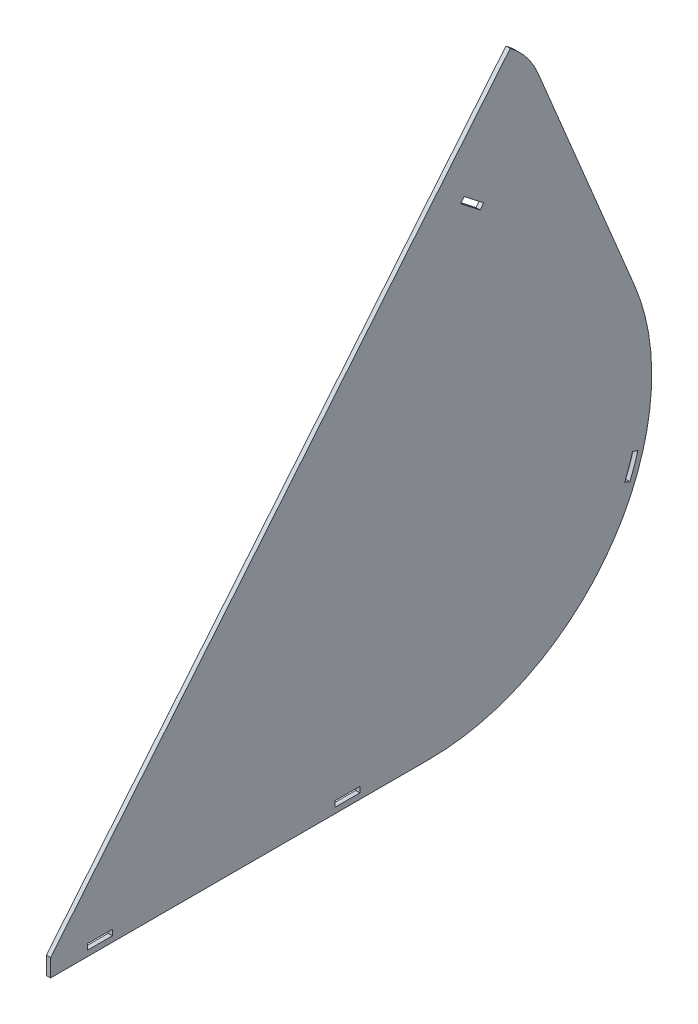
ISO-10303-21;
HEADER;
FILE_DESCRIPTION(('STEP AP214'),'2;1');
FILE_NAME('part.step','',(''),(''),'','','');
FILE_SCHEMA(('AUTOMOTIVE_DESIGN { 1 0 10303 214 1 1 1 1 }'));
ENDSEC;
DATA;
#1=APPLICATION_CONTEXT('core data for automotive mechanical design processes');
#2=APPLICATION_PROTOCOL_DEFINITION('international standard','automotive_design',2000,#1);
#3=PRODUCT_CONTEXT('',#1,'mechanical');
#4=PRODUCT('Part','Part','',(#3));
#5=PRODUCT_RELATED_PRODUCT_CATEGORY('part','',(#4));
#6=PRODUCT_DEFINITION_FORMATION('','',#4);
#7=PRODUCT_DEFINITION_CONTEXT('part definition',#1,'design');
#8=PRODUCT_DEFINITION('design','',#6,#7);
#9=PRODUCT_DEFINITION_SHAPE('','',#8);
#10=(LENGTH_UNIT() NAMED_UNIT(*) SI_UNIT(.MILLI.,.METRE.));
#11=(NAMED_UNIT(*) PLANE_ANGLE_UNIT() SI_UNIT($,.RADIAN.));
#12=(NAMED_UNIT(*) SI_UNIT($,.STERADIAN.) SOLID_ANGLE_UNIT());
#13=UNCERTAINTY_MEASURE_WITH_UNIT(LENGTH_MEASURE(1.E-05),#10,'distance_accuracy_value','');
#14=(GEOMETRIC_REPRESENTATION_CONTEXT(3) GLOBAL_UNCERTAINTY_ASSIGNED_CONTEXT((#13)) GLOBAL_UNIT_ASSIGNED_CONTEXT((#10,
#11,#12)) REPRESENTATION_CONTEXT('',''));
#15=CARTESIAN_POINT('',(0.,0.,0.));
#16=DIRECTION('',(0.,0.,1.));
#17=DIRECTION('',(1.,0.,0.));
#18=AXIS2_PLACEMENT_3D('',#15,#16,#17);
#19=CARTESIAN_POINT('',(-6.,703.932815843124,-580.468471194079));
#20=DIRECTION('',(1.,0.,0.));
#21=DIRECTION('',(0.,0.,-1.));
#22=AXIS2_PLACEMENT_3D('',#19,#20,#21);
#23=CYLINDRICAL_SURFACE('',#22,120.);
#24=CARTESIAN_POINT('',(0.,703.932815843124,-580.468471194079));
#25=DIRECTION('',(1.,0.,0.));
#26=DIRECTION('',(0.,0.,-1.));
#27=AXIS2_PLACEMENT_3D('',#24,#25,#26);
#28=CIRCLE('',#27,120.);
#29=CARTESIAN_POINT('',(0.,750.024971585263,-691.263386145273));
#30=VERTEX_POINT('',#29);
#31=CARTESIAN_POINT('',(0.,800.513923243036,-651.687076160806));
#32=VERTEX_POINT('',#31);
#33=EDGE_CURVE('E225',#30,#32,#28,.T.);
#34=ORIENTED_EDGE('',*,*,#33,.F.);
#35=DIRECTION('',(1.,0.,0.));
#36=VECTOR('',#35,1.);
#37=CARTESIAN_POINT('',(-6.,750.024971585263,-691.263386145273));
#38=LINE('',#37,#36);
#39=CARTESIAN_POINT('',(-6.,750.024971585263,-691.263386145273));
#40=VERTEX_POINT('',#39);
#41=EDGE_CURVE('E11',#40,#30,#38,.T.);
#42=ORIENTED_EDGE('',*,*,#41,.F.);
#43=CARTESIAN_POINT('',(-6.,703.932815843124,-580.468471194079));
#44=DIRECTION('',(1.,0.,0.));
#45=DIRECTION('',(0.,0.,-1.));
#46=AXIS2_PLACEMENT_3D('',#43,#44,#45);
#47=CIRCLE('',#46,120.);
#48=CARTESIAN_POINT('',(-6.,800.513923243036,-651.687076160806));
#49=VERTEX_POINT('',#48);
#50=EDGE_CURVE('E322',#40,#49,#47,.T.);
#51=ORIENTED_EDGE('',*,*,#50,.T.);
#52=DIRECTION('',(1.,0.,0.));
#53=VECTOR('',#52,1.);
#54=CARTESIAN_POINT('',(-6.,800.513923243036,-651.687076160806));
#55=LINE('',#54,#53);
#56=EDGE_CURVE('E41',#49,#32,#55,.T.);
#57=ORIENTED_EDGE('',*,*,#56,.T.);
#58=EDGE_LOOP('',(#34,#42,#51,#57));
#59=FACE_BOUND('',#58,.T.);
#60=ADVANCED_FACE('F38',(#59),#23,.T.);
#61=CARTESIAN_POINT('',(-6.,750.024971585263,-691.263386145273));
#62=DIRECTION('',(0.,0.384101297851157,-0.92329095792662));
#63=DIRECTION('',(0.,0.923290957926621,0.384101297851157));
#64=AXIS2_PLACEMENT_3D('',#61,#62,#63);
#65=PLANE('',#64);
#66=DIRECTION('',(0.,0.92329095792662,0.384101297851157));
#67=VECTOR('',#66,1.);
#68=CARTESIAN_POINT('',(0.,750.024971585263,-691.263386145273));
#69=LINE('',#68,#67);
#70=CARTESIAN_POINT('',(0.,420.991908823115,-828.145509118394));
#71=VERTEX_POINT('',#70);
#72=EDGE_CURVE('E326',#71,#30,#69,.T.);
#73=ORIENTED_EDGE('',*,*,#72,.F.);
#74=DIRECTION('',(1.,0.,0.));
#75=VECTOR('',#74,1.);
#76=CARTESIAN_POINT('',(-6.,420.991908823115,-828.145509118394));
#77=LINE('',#76,#75);
#78=CARTESIAN_POINT('',(-6.,420.991908823115,-828.145509118394));
#79=VERTEX_POINT('',#78);
#80=EDGE_CURVE('E46',#79,#71,#77,.T.);
#81=ORIENTED_EDGE('',*,*,#80,.F.);
#82=DIRECTION('',(0.,0.92329095792662,0.384101297851157));
#83=VECTOR('',#82,1.);
#84=CARTESIAN_POINT('',(-6.,750.024971585263,-691.263386145273));
#85=LINE('',#84,#83);
#86=EDGE_CURVE('E338',#79,#40,#85,.T.);
#87=ORIENTED_EDGE('',*,*,#86,.T.);
#88=ORIENTED_EDGE('',*,*,#41,.T.);
#89=EDGE_LOOP('',(#73,#81,#87,#88));
#90=FACE_BOUND('',#89,.T.);
#91=ADVANCED_FACE('F375',(#90),#65,.T.);
#92=CARTESIAN_POINT('',(-6.,300.,-537.308857371508));
#93=DIRECTION('',(1.,0.,0.));
#94=DIRECTION('',(0.,0.,-1.));
#95=AXIS2_PLACEMENT_3D('',#92,#93,#94);
#96=CYLINDRICAL_SURFACE('',#95,315.);
#97=CARTESIAN_POINT('',(0.,300.,-537.308857371508));
#98=DIRECTION('',(1.,0.,0.));
#99=DIRECTION('',(0.,0.,-1.));
#100=AXIS2_PLACEMENT_3D('',#97,#98,#99);
#101=CIRCLE('',#100,315.);
#102=CARTESIAN_POINT('',(0.,-15.0000000000003,-537.308857371508));
#103=VERTEX_POINT('',#102);
#104=EDGE_CURVE('E352',#103,#71,#101,.T.);
#105=ORIENTED_EDGE('',*,*,#104,.F.);
#106=DIRECTION('',(1.,0.,0.));
#107=VECTOR('',#106,1.);
#108=CARTESIAN_POINT('',(-6.,-15.0000000000003,-537.308857371508));
#109=LINE('',#108,#107);
#110=CARTESIAN_POINT('',(-6.,-15.0000000000003,-537.308857371508));
#111=VERTEX_POINT('',#110);
#112=EDGE_CURVE('E358',#111,#103,#109,.T.);
#113=ORIENTED_EDGE('',*,*,#112,.F.);
#114=CARTESIAN_POINT('',(-6.,300.,-537.308857371508));
#115=DIRECTION('',(1.,0.,0.));
#116=DIRECTION('',(0.,0.,-1.));
#117=AXIS2_PLACEMENT_3D('',#114,#115,#116);
#118=CIRCLE('',#117,315.);
#119=EDGE_CURVE('E335',#111,#79,#118,.T.);
#120=ORIENTED_EDGE('',*,*,#119,.T.);
#121=ORIENTED_EDGE('',*,*,#80,.T.);
#122=EDGE_LOOP('',(#105,#113,#120,#121));
#123=FACE_BOUND('',#122,.T.);
#124=ADVANCED_FACE('F387',(#123),#96,.T.);
#125=CARTESIAN_POINT('',(-6.,-14.9999999999999,-537.308857371508));
#126=DIRECTION('',(0.,-1.,0.));
#127=DIRECTION('',(0.,0.,-1.));
#128=AXIS2_PLACEMENT_3D('',#125,#126,#127);
#129=PLANE('',#128);
#130=DIRECTION('',(0.,0.,-1.));
#131=VECTOR('',#130,1.);
#132=CARTESIAN_POINT('',(0.,-14.9999999999999,-537.308857371508));
#133=LINE('',#132,#131);
#134=CARTESIAN_POINT('',(0.,-15.,0.));
#135=VERTEX_POINT('',#134);
#136=EDGE_CURVE('E349',#135,#103,#133,.T.);
#137=ORIENTED_EDGE('',*,*,#136,.F.);
#138=DIRECTION('',(1.,0.,0.));
#139=VECTOR('',#138,1.);
#140=CARTESIAN_POINT('',(-6.,-15.,0.));
#141=LINE('',#140,#139);
#142=CARTESIAN_POINT('',(-6.,-15.,0.));
#143=VERTEX_POINT('',#142);
#144=EDGE_CURVE('E360',#143,#135,#141,.T.);
#145=ORIENTED_EDGE('',*,*,#144,.F.);
#146=DIRECTION('',(0.,0.,-1.));
#147=VECTOR('',#146,1.);
#148=CARTESIAN_POINT('',(-6.,-14.9999999999999,-537.308857371508));
#149=LINE('',#148,#147);
#150=EDGE_CURVE('E332',#143,#111,#149,.T.);
#151=ORIENTED_EDGE('',*,*,#150,.T.);
#152=ORIENTED_EDGE('',*,*,#112,.T.);
#153=EDGE_LOOP('',(#137,#145,#151,#152));
#154=FACE_BOUND('',#153,.T.);
#155=ADVANCED_FACE('F385',(#154),#129,.T.);
#156=CARTESIAN_POINT('',(-6.,10.,0.));
#157=DIRECTION('',(0.,0.,1.));
#158=DIRECTION('',(0.,-1.,0.));
#159=AXIS2_PLACEMENT_3D('',#156,#157,#158);
#160=PLANE('',#159);
#161=DIRECTION('',(0.,-1.,0.));
#162=VECTOR('',#161,1.);
#163=CARTESIAN_POINT('',(0.,10.,0.));
#164=LINE('',#163,#162);
#165=CARTESIAN_POINT('',(0.,10.,0.));
#166=VERTEX_POINT('',#165);
#167=EDGE_CURVE('E346',#166,#135,#164,.T.);
#168=ORIENTED_EDGE('',*,*,#167,.F.);
#169=DIRECTION('',(1.,0.,0.));
#170=VECTOR('',#169,1.);
#171=CARTESIAN_POINT('',(-6.,10.,0.));
#172=LINE('',#171,#170);
#173=CARTESIAN_POINT('',(-6.,10.,0.));
#174=VERTEX_POINT('',#173);
#175=EDGE_CURVE('E361',#174,#166,#172,.T.);
#176=ORIENTED_EDGE('',*,*,#175,.F.);
#177=DIRECTION('',(0.,-1.,0.));
#178=VECTOR('',#177,1.);
#179=CARTESIAN_POINT('',(-6.,10.,0.));
#180=LINE('',#179,#178);
#181=EDGE_CURVE('E329',#174,#143,#180,.T.);
#182=ORIENTED_EDGE('',*,*,#181,.T.);
#183=ORIENTED_EDGE('',*,*,#144,.T.);
#184=EDGE_LOOP('',(#168,#176,#182,#183));
#185=FACE_BOUND('',#184,.T.);
#186=ADVANCED_FACE('F382',(#185),#160,.T.);
#187=CARTESIAN_POINT('',(-6.,10.,0.));
#188=DIRECTION('',(0.,0.636100121603502,0.771606528805977));
#189=DIRECTION('',(0.,-0.771606528805978,0.636100121603502));
#190=AXIS2_PLACEMENT_3D('',#187,#188,#189);
#191=PLANE('',#190);
#192=DIRECTION('',(0.,-0.771606528805978,0.636100121603502));
#193=VECTOR('',#192,1.);
#194=CARTESIAN_POINT('',(0.,10.,0.));
#195=LINE('',#194,#193);
#196=EDGE_CURVE('E343',#32,#166,#195,.T.);
#197=ORIENTED_EDGE('',*,*,#196,.F.);
#198=ORIENTED_EDGE('',*,*,#56,.F.);
#199=DIRECTION('',(0.,-0.771606528805978,0.636100121603502));
#200=VECTOR('',#199,1.);
#201=CARTESIAN_POINT('',(-6.,10.,0.));
#202=LINE('',#201,#200);
#203=EDGE_CURVE('E325',#49,#174,#202,.T.);
#204=ORIENTED_EDGE('',*,*,#203,.T.);
#205=ORIENTED_EDGE('',*,*,#175,.T.);
#206=EDGE_LOOP('',(#197,#198,#204,#205));
#207=FACE_BOUND('',#206,.T.);
#208=ADVANCED_FACE('F369',(#207),#191,.T.);
#209=CARTESIAN_POINT('',(-6.,703.932815843124,-580.468471194079));
#210=DIRECTION('',(1.,0.,0.));
#211=DIRECTION('',(0.,0.,-1.));
#212=AXIS2_PLACEMENT_3D('',#209,#210,#211);
#213=PLANE('',#212);
#214=DIRECTION('',(0.,-0.372473055479319,-0.928043007054038));
#215=VECTOR('',#214,1.);
#216=CARTESIAN_POINT('',(-6.,186.671566993259,-813.99962828341));
#217=LINE('',#216,#215);
#218=CARTESIAN_POINT('',(-6.,186.671566993259,-813.99962828341));
#219=VERTEX_POINT('',#218);
#220=CARTESIAN_POINT('',(-6.,183.691782549425,-821.423972339843));
#221=VERTEX_POINT('',#220);
#222=EDGE_CURVE('E199',#219,#221,#217,.T.);
#223=ORIENTED_EDGE('',*,*,#222,.T.);
#224=CARTESIAN_POINT('',(-6.,300.,-537.308857371508));
#225=DIRECTION('',(1.,0.,0.));
#226=DIRECTION('',(0.,0.,1.));
#227=AXIS2_PLACEMENT_3D('',#224,#225,#226);
#228=CIRCLE('',#227,307.000000000001);
#229=CARTESIAN_POINT('',(-6.,216.438716825437,-832.717916058307));
#230=VERTEX_POINT('',#229);
#231=EDGE_CURVE('E191',#221,#230,#228,.T.);
#232=ORIENTED_EDGE('',*,*,#231,.T.);
#233=DIRECTION('',(0.,0.278805529625154,0.960347581165506));
#234=VECTOR('',#233,1.);
#235=CARTESIAN_POINT('',(-6.,216.438716825437,-832.717916058307));
#236=LINE('',#235,#234);
#237=CARTESIAN_POINT('',(-6.,218.669161062438,-825.035135408983));
#238=VERTEX_POINT('',#237);
#239=EDGE_CURVE('E202',#230,#238,#236,.T.);
#240=ORIENTED_EDGE('',*,*,#239,.T.);
#241=CARTESIAN_POINT('',(-6.,300.,-537.308857371508));
#242=DIRECTION('',(-1.,0.,0.));
#243=DIRECTION('',(0.,0.,1.));
#244=AXIS2_PLACEMENT_3D('',#241,#242,#243);
#245=CIRCLE('',#244,299.000194708275);
#246=EDGE_CURVE('E54',#238,#219,#245,.T.);
#247=ORIENTED_EDGE('',*,*,#246,.T.);
#248=EDGE_LOOP('',(#223,#232,#240,#247));
#249=FACE_BOUND('',#248,.T.);
#250=DIRECTION('',(0.,0.,1.));
#251=VECTOR('',#250,1.);
#252=CARTESIAN_POINT('',(-6.,0.99999999999993,-87.6709328656834));
#253=LINE('',#252,#251);
#254=CARTESIAN_POINT('',(-6.,0.99999999999993,-87.6709328656834));
#255=VERTEX_POINT('',#254);
#256=CARTESIAN_POINT('',(-6.,0.999999999999925,-52.6709328656833));
#257=VERTEX_POINT('',#256);
#258=EDGE_CURVE('E237',#255,#257,#253,.T.);
#259=ORIENTED_EDGE('',*,*,#258,.T.);
#260=DIRECTION('',(0.,-1.,0.));
#261=VECTOR('',#260,1.);
#262=CARTESIAN_POINT('',(-6.,0.999999999999925,-52.6709328656833));
#263=LINE('',#262,#261);
#264=CARTESIAN_POINT('',(-6.,-7.00000000000001,-52.6709328656833));
#265=VERTEX_POINT('',#264);
#266=EDGE_CURVE('E229',#257,#265,#263,.T.);
#267=ORIENTED_EDGE('',*,*,#266,.T.);
#268=DIRECTION('',(0.,0.,-1.));
#269=VECTOR('',#268,1.);
#270=CARTESIAN_POINT('',(-6.,-7.00000000000001,-52.6709328656833));
#271=LINE('',#270,#269);
#272=CARTESIAN_POINT('',(-6.,-7.00000000000002,-87.6709328656835));
#273=VERTEX_POINT('',#272);
#274=EDGE_CURVE('E232',#265,#273,#271,.T.);
#275=ORIENTED_EDGE('',*,*,#274,.T.);
#276=DIRECTION('',(0.,1.,0.));
#277=VECTOR('',#276,1.);
#278=CARTESIAN_POINT('',(-6.,-7.00000000000001,-87.6709328656834));
#279=LINE('',#278,#277);
#280=EDGE_CURVE('E62',#273,#255,#279,.T.);
#281=ORIENTED_EDGE('',*,*,#280,.T.);
#282=EDGE_LOOP('',(#259,#267,#275,#281));
#283=FACE_BOUND('',#282,.T.);
#284=DIRECTION('',(0.,0.,1.));
#285=VECTOR('',#284,1.);
#286=CARTESIAN_POINT('',(-6.,0.999999999999974,-438.525597194094));
#287=LINE('',#286,#285);
#288=CARTESIAN_POINT('',(-6.,0.999999999999974,-438.525597194094));
#289=VERTEX_POINT('',#288);
#290=CARTESIAN_POINT('',(-6.,0.999999999999969,-403.525597194093));
#291=VERTEX_POINT('',#290);
#292=EDGE_CURVE('E269',#289,#291,#287,.T.);
#293=ORIENTED_EDGE('',*,*,#292,.T.);
#294=DIRECTION('',(0.,-1.,0.));
#295=VECTOR('',#294,1.);
#296=CARTESIAN_POINT('',(-6.,0.999999999999969,-403.525597194093));
#297=LINE('',#296,#295);
#298=CARTESIAN_POINT('',(-6.,-7.00000000000001,-403.525597194093));
#299=VERTEX_POINT('',#298);
#300=EDGE_CURVE('E259',#291,#299,#297,.T.);
#301=ORIENTED_EDGE('',*,*,#300,.T.);
#302=DIRECTION('',(0.,0.,-1.));
#303=VECTOR('',#302,1.);
#304=CARTESIAN_POINT('',(-6.,-7.00000000000001,-403.525597194093));
#305=LINE('',#304,#303);
#306=CARTESIAN_POINT('',(-6.,-7.00000000000001,-438.525597194094));
#307=VERTEX_POINT('',#306);
#308=EDGE_CURVE('E262',#299,#307,#305,.T.);
#309=ORIENTED_EDGE('',*,*,#308,.T.);
#310=DIRECTION('',(0.,1.,0.));
#311=VECTOR('',#310,1.);
#312=CARTESIAN_POINT('',(-6.,-7.00000000000001,-438.525597194094));
#313=LINE('',#312,#311);
#314=EDGE_CURVE('E266',#307,#289,#313,.T.);
#315=ORIENTED_EDGE('',*,*,#314,.T.);
#316=EDGE_LOOP('',(#293,#301,#309,#315));
#317=FACE_BOUND('',#316,.T.);
#318=DIRECTION('',(0.,0.614728916793394,0.788738460364411));
#319=VECTOR('',#318,1.);
#320=CARTESIAN_POINT('',(-6.,629.752125173069,-614.08155827728));
#321=LINE('',#320,#319);
#322=CARTESIAN_POINT('',(-6.,629.752125173069,-614.08155827728));
#323=VERTEX_POINT('',#322);
#324=CARTESIAN_POINT('',(-6.,651.267637260838,-586.475712164526));
#325=VERTEX_POINT('',#324);
#326=EDGE_CURVE('E301',#323,#325,#321,.T.);
#327=ORIENTED_EDGE('',*,*,#326,.T.);
#328=DIRECTION('',(0.,-0.788738460364402,0.614728916793404));
#329=VECTOR('',#328,1.);
#330=CARTESIAN_POINT('',(-6.,651.267637260838,-586.475712164526));
#331=LINE('',#330,#329);
#332=CARTESIAN_POINT('',(-6.,644.957729577923,-581.557880830179));
#333=VERTEX_POINT('',#332);
#334=EDGE_CURVE('E291',#325,#333,#331,.T.);
#335=ORIENTED_EDGE('',*,*,#334,.T.);
#336=DIRECTION('',(0.,-0.614728916793396,-0.788738460364409));
#337=VECTOR('',#336,1.);
#338=CARTESIAN_POINT('',(-6.,644.957729577923,-581.557880830179));
#339=LINE('',#338,#337);
#340=CARTESIAN_POINT('',(-6.,623.442217490154,-609.163726942933));
#341=VERTEX_POINT('',#340);
#342=EDGE_CURVE('E294',#333,#341,#339,.T.);
#343=ORIENTED_EDGE('',*,*,#342,.T.);
#344=DIRECTION('',(0.,0.788738460364407,-0.614728916793398));
#345=VECTOR('',#344,1.);
#346=CARTESIAN_POINT('',(-6.,623.442217490154,-609.163726942933));
#347=LINE('',#346,#345);
#348=EDGE_CURVE('E298',#341,#323,#347,.T.);
#349=ORIENTED_EDGE('',*,*,#348,.T.);
#350=EDGE_LOOP('',(#327,#335,#343,#349));
#351=FACE_BOUND('',#350,.T.);
#352=ORIENTED_EDGE('',*,*,#50,.F.);
#353=ORIENTED_EDGE('',*,*,#86,.F.);
#354=ORIENTED_EDGE('',*,*,#119,.F.);
#355=ORIENTED_EDGE('',*,*,#150,.F.);
#356=ORIENTED_EDGE('',*,*,#181,.F.);
#357=ORIENTED_EDGE('',*,*,#203,.F.);
#358=EDGE_LOOP('',(#352,#353,#354,#355,#356,#357));
#359=FACE_BOUND('',#358,.T.);
#360=ADVANCED_FACE('F206',(#249,#283,#317,#351,#359),#213,.F.);
#361=CARTESIAN_POINT('',(0.,703.932815843124,-580.468471194079));
#362=DIRECTION('',(1.,0.,0.));
#363=DIRECTION('',(0.,0.,-1.));
#364=AXIS2_PLACEMENT_3D('',#361,#362,#363);
#365=PLANE('',#364);
#366=CARTESIAN_POINT('',(0.,300.,-537.308857371508));
#367=DIRECTION('',(1.,0.,0.));
#368=DIRECTION('',(0.,0.,1.));
#369=AXIS2_PLACEMENT_3D('',#366,#367,#368);
#370=CIRCLE('',#369,307.000000000001);
#371=CARTESIAN_POINT('',(0.,183.691782549425,-821.423972339843));
#372=VERTEX_POINT('',#371);
#373=CARTESIAN_POINT('',(0.,216.438716825437,-832.717916058307));
#374=VERTEX_POINT('',#373);
#375=EDGE_CURVE('E194',#372,#374,#370,.T.);
#376=ORIENTED_EDGE('',*,*,#375,.F.);
#377=DIRECTION('',(0.,-0.372473055479319,-0.928043007054038));
#378=VECTOR('',#377,1.);
#379=CARTESIAN_POINT('',(0.,186.671566993259,-813.99962828341));
#380=LINE('',#379,#378);
#381=CARTESIAN_POINT('',(0.,186.671566993259,-813.99962828341));
#382=VERTEX_POINT('',#381);
#383=EDGE_CURVE('E209',#382,#372,#380,.T.);
#384=ORIENTED_EDGE('',*,*,#383,.F.);
#385=CARTESIAN_POINT('',(0.,300.,-537.308857371508));
#386=DIRECTION('',(-1.,0.,0.));
#387=DIRECTION('',(0.,0.,1.));
#388=AXIS2_PLACEMENT_3D('',#385,#386,#387);
#389=CIRCLE('',#388,299.000194708275);
#390=CARTESIAN_POINT('',(0.,218.669161062438,-825.035135408983));
#391=VERTEX_POINT('',#390);
#392=EDGE_CURVE('E212',#391,#382,#389,.T.);
#393=ORIENTED_EDGE('',*,*,#392,.F.);
#394=DIRECTION('',(0.,0.278805529625154,0.960347581165506));
#395=VECTOR('',#394,1.);
#396=CARTESIAN_POINT('',(0.,216.438716825437,-832.717916058307));
#397=LINE('',#396,#395);
#398=EDGE_CURVE('E218',#374,#391,#397,.T.);
#399=ORIENTED_EDGE('',*,*,#398,.F.);
#400=EDGE_LOOP('',(#376,#384,#393,#399));
#401=FACE_BOUND('',#400,.T.);
#402=DIRECTION('',(0.,-1.,0.));
#403=VECTOR('',#402,1.);
#404=CARTESIAN_POINT('',(0.,0.999999999999925,-52.6709328656833));
#405=LINE('',#404,#403);
#406=CARTESIAN_POINT('',(0.,0.999999999999925,-52.6709328656833));
#407=VERTEX_POINT('',#406);
#408=CARTESIAN_POINT('',(0.,-7.00000000000002,-52.6709328656834));
#409=VERTEX_POINT('',#408);
#410=EDGE_CURVE('E241',#407,#409,#405,.T.);
#411=ORIENTED_EDGE('',*,*,#410,.F.);
#412=DIRECTION('',(0.,0.,1.));
#413=VECTOR('',#412,1.);
#414=CARTESIAN_POINT('',(0.,0.99999999999993,-87.6709328656834));
#415=LINE('',#414,#413);
#416=CARTESIAN_POINT('',(0.,0.99999999999993,-87.6709328656834));
#417=VERTEX_POINT('',#416);
#418=EDGE_CURVE('E233',#417,#407,#415,.T.);
#419=ORIENTED_EDGE('',*,*,#418,.F.);
#420=DIRECTION('',(0.,1.,0.));
#421=VECTOR('',#420,1.);
#422=CARTESIAN_POINT('',(0.,-7.00000000000001,-87.6709328656834));
#423=LINE('',#422,#421);
#424=CARTESIAN_POINT('',(0.,-7.00000000000001,-87.6709328656834));
#425=VERTEX_POINT('',#424);
#426=EDGE_CURVE('E247',#425,#417,#423,.T.);
#427=ORIENTED_EDGE('',*,*,#426,.F.);
#428=DIRECTION('',(0.,0.,-1.));
#429=VECTOR('',#428,1.);
#430=CARTESIAN_POINT('',(0.,-7.00000000000001,-52.6709328656833));
#431=LINE('',#430,#429);
#432=EDGE_CURVE('E243',#409,#425,#431,.T.);
#433=ORIENTED_EDGE('',*,*,#432,.F.);
#434=EDGE_LOOP('',(#411,#419,#427,#433));
#435=FACE_BOUND('',#434,.T.);
#436=DIRECTION('',(0.,-1.,0.));
#437=VECTOR('',#436,1.);
#438=CARTESIAN_POINT('',(0.,0.999999999999969,-403.525597194093));
#439=LINE('',#438,#437);
#440=CARTESIAN_POINT('',(0.,0.999999999999969,-403.525597194093));
#441=VERTEX_POINT('',#440);
#442=CARTESIAN_POINT('',(0.,-7.00000000000001,-403.525597194094));
#443=VERTEX_POINT('',#442);
#444=EDGE_CURVE('E273',#441,#443,#439,.T.);
#445=ORIENTED_EDGE('',*,*,#444,.F.);
#446=DIRECTION('',(0.,0.,1.));
#447=VECTOR('',#446,1.);
#448=CARTESIAN_POINT('',(0.,0.999999999999974,-438.525597194094));
#449=LINE('',#448,#447);
#450=CARTESIAN_POINT('',(0.,0.999999999999974,-438.525597194094));
#451=VERTEX_POINT('',#450);
#452=EDGE_CURVE('E263',#451,#441,#449,.T.);
#453=ORIENTED_EDGE('',*,*,#452,.F.);
#454=DIRECTION('',(0.,1.,0.));
#455=VECTOR('',#454,1.);
#456=CARTESIAN_POINT('',(0.,-7.00000000000001,-438.525597194094));
#457=LINE('',#456,#455);
#458=CARTESIAN_POINT('',(0.,-7.00000000000001,-438.525597194094));
#459=VERTEX_POINT('',#458);
#460=EDGE_CURVE('E279',#459,#451,#457,.T.);
#461=ORIENTED_EDGE('',*,*,#460,.F.);
#462=DIRECTION('',(0.,0.,-1.));
#463=VECTOR('',#462,1.);
#464=CARTESIAN_POINT('',(0.,-7.00000000000001,-403.525597194093));
#465=LINE('',#464,#463);
#466=EDGE_CURVE('E275',#443,#459,#465,.T.);
#467=ORIENTED_EDGE('',*,*,#466,.F.);
#468=EDGE_LOOP('',(#445,#453,#461,#467));
#469=FACE_BOUND('',#468,.T.);
#470=DIRECTION('',(0.,-0.788738460364402,0.614728916793404));
#471=VECTOR('',#470,1.);
#472=CARTESIAN_POINT('',(0.,651.267637260838,-586.475712164526));
#473=LINE('',#472,#471);
#474=CARTESIAN_POINT('',(0.,651.267637260838,-586.475712164526));
#475=VERTEX_POINT('',#474);
#476=CARTESIAN_POINT('',(0.,644.957729577923,-581.557880830179));
#477=VERTEX_POINT('',#476);
#478=EDGE_CURVE('E305',#475,#477,#473,.T.);
#479=ORIENTED_EDGE('',*,*,#478,.F.);
#480=DIRECTION('',(0.,0.614728916793394,0.788738460364411));
#481=VECTOR('',#480,1.);
#482=CARTESIAN_POINT('',(0.,629.752125173069,-614.08155827728));
#483=LINE('',#482,#481);
#484=CARTESIAN_POINT('',(0.,629.752125173069,-614.08155827728));
#485=VERTEX_POINT('',#484);
#486=EDGE_CURVE('E295',#485,#475,#483,.T.);
#487=ORIENTED_EDGE('',*,*,#486,.F.);
#488=DIRECTION('',(0.,0.788738460364407,-0.614728916793398));
#489=VECTOR('',#488,1.);
#490=CARTESIAN_POINT('',(0.,623.442217490154,-609.163726942933));
#491=LINE('',#490,#489);
#492=CARTESIAN_POINT('',(0.,623.442217490154,-609.163726942933));
#493=VERTEX_POINT('',#492);
#494=EDGE_CURVE('E310',#493,#485,#491,.T.);
#495=ORIENTED_EDGE('',*,*,#494,.F.);
#496=DIRECTION('',(0.,-0.614728916793396,-0.788738460364409));
#497=VECTOR('',#496,1.);
#498=CARTESIAN_POINT('',(0.,644.957729577923,-581.557880830179));
#499=LINE('',#498,#497);
#500=EDGE_CURVE('E307',#477,#493,#499,.T.);
#501=ORIENTED_EDGE('',*,*,#500,.F.);
#502=EDGE_LOOP('',(#479,#487,#495,#501));
#503=FACE_BOUND('',#502,.T.);
#504=ORIENTED_EDGE('',*,*,#33,.T.);
#505=ORIENTED_EDGE('',*,*,#196,.T.);
#506=ORIENTED_EDGE('',*,*,#167,.T.);
#507=ORIENTED_EDGE('',*,*,#136,.T.);
#508=ORIENTED_EDGE('',*,*,#104,.T.);
#509=ORIENTED_EDGE('',*,*,#72,.T.);
#510=EDGE_LOOP('',(#504,#505,#506,#507,#508,#509));
#511=FACE_BOUND('',#510,.T.);
#512=ADVANCED_FACE('F371',(#401,#435,#469,#503,#511),#365,.T.);
#513=CARTESIAN_POINT('',(-6.,651.267637260838,-586.475712164526));
#514=DIRECTION('',(0.,0.614728916793404,0.788738460364402));
#515=DIRECTION('',(0.,-0.788738460364402,0.614728916793404));
#516=AXIS2_PLACEMENT_3D('',#513,#514,#515);
#517=PLANE('',#516);
#518=ORIENTED_EDGE('',*,*,#478,.T.);
#519=DIRECTION('',(1.,0.,0.));
#520=VECTOR('',#519,1.);
#521=CARTESIAN_POINT('',(-6.,644.957729577923,-581.557880830179));
#522=LINE('',#521,#520);
#523=EDGE_CURVE('E304',#333,#477,#522,.T.);
#524=ORIENTED_EDGE('',*,*,#523,.F.);
#525=ORIENTED_EDGE('',*,*,#334,.F.);
#526=DIRECTION('',(1.,0.,0.));
#527=VECTOR('',#526,1.);
#528=CARTESIAN_POINT('',(-6.,651.267637260838,-586.475712164526));
#529=LINE('',#528,#527);
#530=EDGE_CURVE('E276',#325,#475,#529,.T.);
#531=ORIENTED_EDGE('',*,*,#530,.T.);
#532=EDGE_LOOP('',(#518,#524,#525,#531));
#533=FACE_BOUND('',#532,.T.);
#534=ADVANCED_FACE('F451',(#533),#517,.F.);
#535=CARTESIAN_POINT('',(-6.,629.752125173069,-614.08155827728));
#536=DIRECTION('',(0.,0.788738460364411,-0.614728916793394));
#537=DIRECTION('',(0.,0.614728916793394,0.788738460364411));
#538=AXIS2_PLACEMENT_3D('',#535,#536,#537);
#539=PLANE('',#538);
#540=ORIENTED_EDGE('',*,*,#486,.T.);
#541=ORIENTED_EDGE('',*,*,#530,.F.);
#542=ORIENTED_EDGE('',*,*,#326,.F.);
#543=DIRECTION('',(1.,0.,0.));
#544=VECTOR('',#543,1.);
#545=CARTESIAN_POINT('',(-6.,629.752125173069,-614.08155827728));
#546=LINE('',#545,#544);
#547=EDGE_CURVE('E316',#323,#485,#546,.T.);
#548=ORIENTED_EDGE('',*,*,#547,.T.);
#549=EDGE_LOOP('',(#540,#541,#542,#548));
#550=FACE_BOUND('',#549,.T.);
#551=ADVANCED_FACE('F462',(#550),#539,.F.);
#552=CARTESIAN_POINT('',(-6.,623.442217490154,-609.163726942933));
#553=DIRECTION('',(0.,-0.614728916793398,-0.788738460364407));
#554=DIRECTION('',(0.,0.788738460364408,-0.614728916793398));
#555=AXIS2_PLACEMENT_3D('',#552,#553,#554);
#556=PLANE('',#555);
#557=ORIENTED_EDGE('',*,*,#494,.T.);
#558=ORIENTED_EDGE('',*,*,#547,.F.);
#559=ORIENTED_EDGE('',*,*,#348,.F.);
#560=DIRECTION('',(1.,0.,0.));
#561=VECTOR('',#560,1.);
#562=CARTESIAN_POINT('',(-6.,623.442217490154,-609.163726942933));
#563=LINE('',#562,#561);
#564=EDGE_CURVE('E318',#341,#493,#563,.T.);
#565=ORIENTED_EDGE('',*,*,#564,.T.);
#566=EDGE_LOOP('',(#557,#558,#559,#565));
#567=FACE_BOUND('',#566,.T.);
#568=ADVANCED_FACE('F472',(#567),#556,.F.);
#569=CARTESIAN_POINT('',(-6.,644.957729577923,-581.557880830179));
#570=DIRECTION('',(0.,-0.788738460364409,0.614728916793396));
#571=DIRECTION('',(0.,-0.614728916793396,-0.788738460364409));
#572=AXIS2_PLACEMENT_3D('',#569,#570,#571);
#573=PLANE('',#572);
#574=ORIENTED_EDGE('',*,*,#500,.T.);
#575=ORIENTED_EDGE('',*,*,#564,.F.);
#576=ORIENTED_EDGE('',*,*,#342,.F.);
#577=ORIENTED_EDGE('',*,*,#523,.T.);
#578=EDGE_LOOP('',(#574,#575,#576,#577));
#579=FACE_BOUND('',#578,.T.);
#580=ADVANCED_FACE('F482',(#579),#573,.F.);
#581=CARTESIAN_POINT('',(-6.,0.999999999999969,-403.525597194093));
#582=DIRECTION('',(0.,0.,1.));
#583=DIRECTION('',(1.,0.,0.));
#584=AXIS2_PLACEMENT_3D('',#581,#582,#583);
#585=PLANE('',#584);
#586=ORIENTED_EDGE('',*,*,#444,.T.);
#587=DIRECTION('',(1.,0.,0.));
#588=VECTOR('',#587,1.);
#589=CARTESIAN_POINT('',(-6.,-7.00000000000001,-403.525597194093));
#590=LINE('',#589,#588);
#591=EDGE_CURVE('E272',#299,#443,#590,.T.);
#592=ORIENTED_EDGE('',*,*,#591,.F.);
#593=ORIENTED_EDGE('',*,*,#300,.F.);
#594=DIRECTION('',(1.,0.,0.));
#595=VECTOR('',#594,1.);
#596=CARTESIAN_POINT('',(-6.,0.999999999999969,-403.525597194093));
#597=LINE('',#596,#595);
#598=EDGE_CURVE('E244',#291,#441,#597,.T.);
#599=ORIENTED_EDGE('',*,*,#598,.T.);
#600=EDGE_LOOP('',(#586,#592,#593,#599));
#601=FACE_BOUND('',#600,.T.);
#602=ADVANCED_FACE('F492',(#601),#585,.F.);
#603=CARTESIAN_POINT('',(-6.,0.999999999999974,-438.525597194094));
#604=DIRECTION('',(0.,1.,0.));
#605=DIRECTION('',(0.,0.,1.));
#606=AXIS2_PLACEMENT_3D('',#603,#604,#605);
#607=PLANE('',#606);
#608=ORIENTED_EDGE('',*,*,#452,.T.);
#609=ORIENTED_EDGE('',*,*,#598,.F.);
#610=ORIENTED_EDGE('',*,*,#292,.F.);
#611=DIRECTION('',(1.,0.,0.));
#612=VECTOR('',#611,1.);
#613=CARTESIAN_POINT('',(-6.,0.999999999999974,-438.525597194094));
#614=LINE('',#613,#612);
#615=EDGE_CURVE('E285',#289,#451,#614,.T.);
#616=ORIENTED_EDGE('',*,*,#615,.T.);
#617=EDGE_LOOP('',(#608,#609,#610,#616));
#618=FACE_BOUND('',#617,.T.);
#619=ADVANCED_FACE('F502',(#618),#607,.F.);
#620=CARTESIAN_POINT('',(-6.,-7.00000000000001,-438.525597194094));
#621=DIRECTION('',(0.,0.,-1.));
#622=DIRECTION('',(-1.,0.,0.));
#623=AXIS2_PLACEMENT_3D('',#620,#621,#622);
#624=PLANE('',#623);
#625=ORIENTED_EDGE('',*,*,#460,.T.);
#626=ORIENTED_EDGE('',*,*,#615,.F.);
#627=ORIENTED_EDGE('',*,*,#314,.F.);
#628=DIRECTION('',(1.,0.,0.));
#629=VECTOR('',#628,1.);
#630=CARTESIAN_POINT('',(-6.,-7.00000000000001,-438.525597194094));
#631=LINE('',#630,#629);
#632=EDGE_CURVE('E287',#307,#459,#631,.T.);
#633=ORIENTED_EDGE('',*,*,#632,.T.);
#634=EDGE_LOOP('',(#625,#626,#627,#633));
#635=FACE_BOUND('',#634,.T.);
#636=ADVANCED_FACE('F512',(#635),#624,.F.);
#637=CARTESIAN_POINT('',(-6.,-7.00000000000001,-403.525597194093));
#638=DIRECTION('',(0.,-1.,0.));
#639=DIRECTION('',(0.,0.,-1.));
#640=AXIS2_PLACEMENT_3D('',#637,#638,#639);
#641=PLANE('',#640);
#642=ORIENTED_EDGE('',*,*,#466,.T.);
#643=ORIENTED_EDGE('',*,*,#632,.F.);
#644=ORIENTED_EDGE('',*,*,#308,.F.);
#645=ORIENTED_EDGE('',*,*,#591,.T.);
#646=EDGE_LOOP('',(#642,#643,#644,#645));
#647=FACE_BOUND('',#646,.T.);
#648=ADVANCED_FACE('F522',(#647),#641,.F.);
#649=CARTESIAN_POINT('',(-6.,0.999999999999925,-52.6709328656833));
#650=DIRECTION('',(0.,0.,1.));
#651=DIRECTION('',(1.,0.,0.));
#652=AXIS2_PLACEMENT_3D('',#649,#650,#651);
#653=PLANE('',#652);
#654=ORIENTED_EDGE('',*,*,#410,.T.);
#655=DIRECTION('',(1.,0.,0.));
#656=VECTOR('',#655,1.);
#657=CARTESIAN_POINT('',(-6.,-7.00000000000001,-52.6709328656833));
#658=LINE('',#657,#656);
#659=EDGE_CURVE('E240',#265,#409,#658,.T.);
#660=ORIENTED_EDGE('',*,*,#659,.F.);
#661=ORIENTED_EDGE('',*,*,#266,.F.);
#662=DIRECTION('',(1.,0.,0.));
#663=VECTOR('',#662,1.);
#664=CARTESIAN_POINT('',(-6.,0.999999999999925,-52.6709328656833));
#665=LINE('',#664,#663);
#666=EDGE_CURVE('E219',#257,#407,#665,.T.);
#667=ORIENTED_EDGE('',*,*,#666,.T.);
#668=EDGE_LOOP('',(#654,#660,#661,#667));
#669=FACE_BOUND('',#668,.T.);
#670=ADVANCED_FACE('F532',(#669),#653,.F.);
#671=CARTESIAN_POINT('',(-6.,0.99999999999993,-87.6709328656834));
#672=DIRECTION('',(0.,1.,0.));
#673=DIRECTION('',(0.,0.,1.));
#674=AXIS2_PLACEMENT_3D('',#671,#672,#673);
#675=PLANE('',#674);
#676=ORIENTED_EDGE('',*,*,#418,.T.);
#677=ORIENTED_EDGE('',*,*,#666,.F.);
#678=ORIENTED_EDGE('',*,*,#258,.F.);
#679=DIRECTION('',(1.,0.,0.));
#680=VECTOR('',#679,1.);
#681=CARTESIAN_POINT('',(-6.,0.99999999999993,-87.6709328656834));
#682=LINE('',#681,#680);
#683=EDGE_CURVE('E253',#255,#417,#682,.T.);
#684=ORIENTED_EDGE('',*,*,#683,.T.);
#685=EDGE_LOOP('',(#676,#677,#678,#684));
#686=FACE_BOUND('',#685,.T.);
#687=ADVANCED_FACE('F542',(#686),#675,.F.);
#688=CARTESIAN_POINT('',(-6.,-7.00000000000001,-87.6709328656834));
#689=DIRECTION('',(0.,0.,-1.));
#690=DIRECTION('',(0.,1.,0.));
#691=AXIS2_PLACEMENT_3D('',#688,#689,#690);
#692=PLANE('',#691);
#693=ORIENTED_EDGE('',*,*,#426,.T.);
#694=ORIENTED_EDGE('',*,*,#683,.F.);
#695=ORIENTED_EDGE('',*,*,#280,.F.);
#696=DIRECTION('',(1.,0.,0.));
#697=VECTOR('',#696,1.);
#698=CARTESIAN_POINT('',(-6.,-7.00000000000001,-87.6709328656834));
#699=LINE('',#698,#697);
#700=EDGE_CURVE('E255',#273,#425,#699,.T.);
#701=ORIENTED_EDGE('',*,*,#700,.T.);
#702=EDGE_LOOP('',(#693,#694,#695,#701));
#703=FACE_BOUND('',#702,.T.);
#704=ADVANCED_FACE('F552',(#703),#692,.F.);
#705=CARTESIAN_POINT('',(-6.,-7.00000000000001,-52.6709328656833));
#706=DIRECTION('',(0.,-1.,0.));
#707=DIRECTION('',(0.,0.,-1.));
#708=AXIS2_PLACEMENT_3D('',#705,#706,#707);
#709=PLANE('',#708);
#710=ORIENTED_EDGE('',*,*,#432,.T.);
#711=ORIENTED_EDGE('',*,*,#700,.F.);
#712=ORIENTED_EDGE('',*,*,#274,.F.);
#713=ORIENTED_EDGE('',*,*,#659,.T.);
#714=EDGE_LOOP('',(#710,#711,#712,#713));
#715=FACE_BOUND('',#714,.T.);
#716=ADVANCED_FACE('F562',(#715),#709,.F.);
#717=CARTESIAN_POINT('',(-6.,300.,-537.308857371508));
#718=DIRECTION('',(1.,0.,0.));
#719=DIRECTION('',(0.,0.,-1.));
#720=AXIS2_PLACEMENT_3D('',#717,#718,#719);
#721=CYLINDRICAL_SURFACE('',#720,307.000000000001);
#722=ORIENTED_EDGE('',*,*,#375,.T.);
#723=DIRECTION('',(1.,0.,0.));
#724=VECTOR('',#723,1.);
#725=CARTESIAN_POINT('',(-6.,216.438716825437,-832.717916058307));
#726=LINE('',#725,#724);
#727=EDGE_CURVE('E187',#230,#374,#726,.T.);
#728=ORIENTED_EDGE('',*,*,#727,.F.);
#729=ORIENTED_EDGE('',*,*,#231,.F.);
#730=DIRECTION('',(1.,0.,0.));
#731=VECTOR('',#730,1.);
#732=CARTESIAN_POINT('',(-6.,183.691782549425,-821.423972339843));
#733=LINE('',#732,#731);
#734=EDGE_CURVE('E223',#221,#372,#733,.T.);
#735=ORIENTED_EDGE('',*,*,#734,.T.);
#736=EDGE_LOOP('',(#722,#728,#729,#735));
#737=FACE_BOUND('',#736,.T.);
#738=ADVANCED_FACE('F189',(#737),#721,.F.);
#739=CARTESIAN_POINT('',(-6.,186.671566993259,-813.99962828341));
#740=DIRECTION('',(0.,-0.928043007054037,0.372473055479319));
#741=DIRECTION('',(0.,-0.372473055479319,-0.928043007054038));
#742=AXIS2_PLACEMENT_3D('',#739,#740,#741);
#743=PLANE('',#742);
#744=ORIENTED_EDGE('',*,*,#383,.T.);
#745=ORIENTED_EDGE('',*,*,#734,.F.);
#746=ORIENTED_EDGE('',*,*,#222,.F.);
#747=DIRECTION('',(1.,0.,0.));
#748=VECTOR('',#747,1.);
#749=CARTESIAN_POINT('',(-6.,186.671566993259,-813.99962828341));
#750=LINE('',#749,#748);
#751=EDGE_CURVE('E226',#219,#382,#750,.T.);
#752=ORIENTED_EDGE('',*,*,#751,.T.);
#753=EDGE_LOOP('',(#744,#745,#746,#752));
#754=FACE_BOUND('',#753,.T.);
#755=ADVANCED_FACE('F580',(#754),#743,.F.);
#756=CARTESIAN_POINT('',(-6.,300.,-537.308857371508));
#757=DIRECTION('',(1.,0.,0.));
#758=DIRECTION('',(0.,0.,-1.));
#759=AXIS2_PLACEMENT_3D('',#756,#757,#758);
#760=CYLINDRICAL_SURFACE('',#759,299.000194708275);
#761=ORIENTED_EDGE('',*,*,#392,.T.);
#762=ORIENTED_EDGE('',*,*,#751,.F.);
#763=ORIENTED_EDGE('',*,*,#246,.F.);
#764=DIRECTION('',(1.,0.,0.));
#765=VECTOR('',#764,1.);
#766=CARTESIAN_POINT('',(-6.,218.669161062438,-825.035135408983));
#767=LINE('',#766,#765);
#768=EDGE_CURVE('E198',#238,#391,#767,.T.);
#769=ORIENTED_EDGE('',*,*,#768,.T.);
#770=EDGE_LOOP('',(#761,#762,#763,#769));
#771=FACE_BOUND('',#770,.T.);
#772=ADVANCED_FACE('F589',(#771),#760,.T.);
#773=CARTESIAN_POINT('',(-6.,216.438716825437,-832.717916058307));
#774=DIRECTION('',(0.,0.960347581165506,-0.278805529625154));
#775=DIRECTION('',(0.,0.278805529625154,0.960347581165506));
#776=AXIS2_PLACEMENT_3D('',#773,#774,#775);
#777=PLANE('',#776);
#778=ORIENTED_EDGE('',*,*,#398,.T.);
#779=ORIENTED_EDGE('',*,*,#768,.F.);
#780=ORIENTED_EDGE('',*,*,#239,.F.);
#781=ORIENTED_EDGE('',*,*,#727,.T.);
#782=EDGE_LOOP('',(#778,#779,#780,#781));
#783=FACE_BOUND('',#782,.T.);
#784=ADVANCED_FACE('F203',(#783),#777,.F.);
#785=CLOSED_SHELL('',(#60,#91,#124,#155,#186,#208,#360,#512,#534,#551,#568,#580,#602,#619,#636,
#648,#670,#687,#704,#716,#738,#755,#772,#784));
#786=MANIFOLD_SOLID_BREP('B2',#785);
#787=ADVANCED_BREP_SHAPE_REPRESENTATION('',(#18,#786),#14);
#788=SHAPE_DEFINITION_REPRESENTATION(#9,#787);
ENDSEC;
END-ISO-10303-21;
